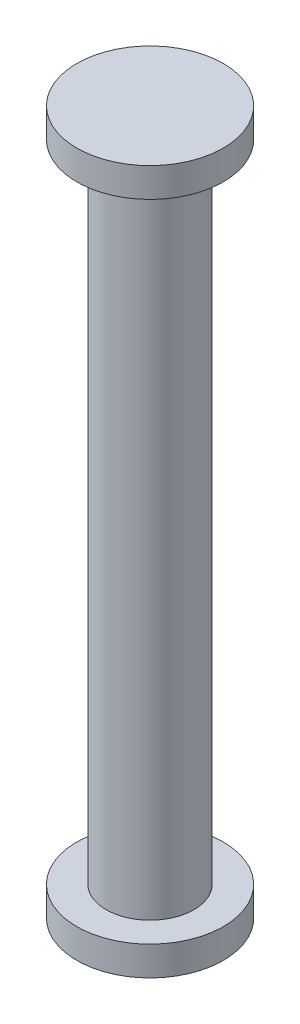
ISO-10303-21;
HEADER;
FILE_DESCRIPTION(('STEP AP214'),'2;1');
FILE_NAME('part.step','',(''),(''),'','','');
FILE_SCHEMA(('AUTOMOTIVE_DESIGN { 1 0 10303 214 1 1 1 1 }'));
ENDSEC;
DATA;
#1=APPLICATION_CONTEXT('core data for automotive mechanical design processes');
#2=APPLICATION_PROTOCOL_DEFINITION('international standard','automotive_design',2000,#1);
#3=PRODUCT_CONTEXT('',#1,'mechanical');
#4=PRODUCT('Part','Part','',(#3));
#5=PRODUCT_RELATED_PRODUCT_CATEGORY('part','',(#4));
#6=PRODUCT_DEFINITION_FORMATION('','',#4);
#7=PRODUCT_DEFINITION_CONTEXT('part definition',#1,'design');
#8=PRODUCT_DEFINITION('design','',#6,#7);
#9=PRODUCT_DEFINITION_SHAPE('','',#8);
#10=(LENGTH_UNIT() NAMED_UNIT(*) SI_UNIT(.MILLI.,.METRE.));
#11=(NAMED_UNIT(*) PLANE_ANGLE_UNIT() SI_UNIT($,.RADIAN.));
#12=(NAMED_UNIT(*) SI_UNIT($,.STERADIAN.) SOLID_ANGLE_UNIT());
#13=UNCERTAINTY_MEASURE_WITH_UNIT(LENGTH_MEASURE(1.E-05),#10,'distance_accuracy_value','');
#14=(GEOMETRIC_REPRESENTATION_CONTEXT(3) GLOBAL_UNCERTAINTY_ASSIGNED_CONTEXT((#13)) GLOBAL_UNIT_ASSIGNED_CONTEXT((#10,
#11,#12)) REPRESENTATION_CONTEXT('',''));
#15=CARTESIAN_POINT('',(0.,0.,0.));
#16=DIRECTION('',(0.,0.,1.));
#17=DIRECTION('',(1.,0.,0.));
#18=AXIS2_PLACEMENT_3D('',#15,#16,#17);
#19=CARTESIAN_POINT('',(-2.5,0.,0.));
#20=DIRECTION('',(0.,1.,0.));
#21=DIRECTION('',(0.,0.,1.));
#22=AXIS2_PLACEMENT_3D('',#19,#20,#21);
#23=PLANE('',#22);
#24=CARTESIAN_POINT('',(0.,0.,0.));
#25=DIRECTION('',(0.,-1.,0.));
#26=DIRECTION('',(0.,0.,-1.));
#27=AXIS2_PLACEMENT_3D('',#24,#25,#26);
#28=CIRCLE('',#27,2.5);
#29=CARTESIAN_POINT('',(0.,0.,-2.5));
#30=VERTEX_POINT('',#29);
#31=EDGE_CURVE('E57',#30,#30,#28,.T.);
#32=ORIENTED_EDGE('',*,*,#31,.T.);
#33=EDGE_LOOP('',(#32));
#34=FACE_BOUND('',#33,.T.);
#35=ADVANCED_FACE('F35',(#34),#23,.F.);
#36=CARTESIAN_POINT('',(0.,24.,0.));
#37=DIRECTION('',(0.,-1.,0.));
#38=DIRECTION('',(0.,0.,-1.));
#39=AXIS2_PLACEMENT_3D('',#36,#37,#38);
#40=PLANE('',#39);
#41=CARTESIAN_POINT('',(0.,24.,0.));
#42=DIRECTION('',(0.,-1.,0.));
#43=DIRECTION('',(0.,0.,-1.));
#44=AXIS2_PLACEMENT_3D('',#41,#42,#43);
#45=CIRCLE('',#44,2.5);
#46=CARTESIAN_POINT('',(0.,24.,-2.5));
#47=VERTEX_POINT('',#46);
#48=EDGE_CURVE('E10',#47,#47,#45,.T.);
#49=ORIENTED_EDGE('',*,*,#48,.F.);
#50=EDGE_LOOP('',(#49));
#51=FACE_BOUND('',#50,.T.);
#52=ADVANCED_FACE('F87',(#51),#40,.F.);
#53=CARTESIAN_POINT('',(0.,0.,0.));
#54=DIRECTION('',(0.,-1.,0.));
#55=DIRECTION('',(0.,0.,-1.));
#56=AXIS2_PLACEMENT_3D('',#53,#54,#55);
#57=CYLINDRICAL_SURFACE('',#56,2.5);
#58=CARTESIAN_POINT('',(0.,23.,0.));
#59=DIRECTION('',(0.,-1.,0.));
#60=DIRECTION('',(0.,0.,-1.));
#61=AXIS2_PLACEMENT_3D('',#58,#59,#60);
#62=CIRCLE('',#61,2.5);
#63=CARTESIAN_POINT('',(0.,23.,-2.5));
#64=VERTEX_POINT('',#63);
#65=EDGE_CURVE('E41',#64,#64,#62,.T.);
#66=ORIENTED_EDGE('',*,*,#65,.F.);
#67=EDGE_LOOP('',(#66));
#68=FACE_BOUND('',#67,.T.);
#69=ORIENTED_EDGE('',*,*,#48,.T.);
#70=EDGE_LOOP('',(#69));
#71=FACE_BOUND('',#70,.T.);
#72=ADVANCED_FACE('F82',(#68,#71),#57,.T.);
#73=CARTESIAN_POINT('',(-2.5,23.,0.));
#74=DIRECTION('',(0.,1.,0.));
#75=DIRECTION('',(0.,0.,1.));
#76=AXIS2_PLACEMENT_3D('',#73,#74,#75);
#77=PLANE('',#76);
#78=CARTESIAN_POINT('',(0.,23.,0.));
#79=DIRECTION('',(0.,-1.,0.));
#80=DIRECTION('',(0.,0.,-1.));
#81=AXIS2_PLACEMENT_3D('',#78,#79,#80);
#82=CIRCLE('',#81,1.5);
#83=CARTESIAN_POINT('',(0.,23.,-1.5));
#84=VERTEX_POINT('',#83);
#85=EDGE_CURVE('E45',#84,#84,#82,.T.);
#86=ORIENTED_EDGE('',*,*,#85,.F.);
#87=EDGE_LOOP('',(#86));
#88=FACE_BOUND('',#87,.T.);
#89=ORIENTED_EDGE('',*,*,#65,.T.);
#90=EDGE_LOOP('',(#89));
#91=FACE_BOUND('',#90,.T.);
#92=ADVANCED_FACE('F77',(#88,#91),#77,.F.);
#93=CARTESIAN_POINT('',(0.,0.,0.));
#94=DIRECTION('',(0.,-1.,0.));
#95=DIRECTION('',(0.,0.,-1.));
#96=AXIS2_PLACEMENT_3D('',#93,#94,#95);
#97=CYLINDRICAL_SURFACE('',#96,1.5);
#98=CARTESIAN_POINT('',(0.,1.,0.));
#99=DIRECTION('',(0.,-1.,0.));
#100=DIRECTION('',(0.,0.,-1.));
#101=AXIS2_PLACEMENT_3D('',#98,#99,#100);
#102=CIRCLE('',#101,1.5);
#103=CARTESIAN_POINT('',(0.,1.,-1.5));
#104=VERTEX_POINT('',#103);
#105=EDGE_CURVE('E49',#104,#104,#102,.T.);
#106=ORIENTED_EDGE('',*,*,#105,.F.);
#107=EDGE_LOOP('',(#106));
#108=FACE_BOUND('',#107,.T.);
#109=ORIENTED_EDGE('',*,*,#85,.T.);
#110=EDGE_LOOP('',(#109));
#111=FACE_BOUND('',#110,.T.);
#112=ADVANCED_FACE('F71',(#108,#111),#97,.T.);
#113=CARTESIAN_POINT('',(-1.5,1.,0.));
#114=DIRECTION('',(0.,-1.,0.));
#115=DIRECTION('',(0.,0.,-1.));
#116=AXIS2_PLACEMENT_3D('',#113,#114,#115);
#117=PLANE('',#116);
#118=CARTESIAN_POINT('',(0.,1.,0.));
#119=DIRECTION('',(0.,-1.,0.));
#120=DIRECTION('',(0.,0.,-1.));
#121=AXIS2_PLACEMENT_3D('',#118,#119,#120);
#122=CIRCLE('',#121,2.5);
#123=CARTESIAN_POINT('',(0.,1.,-2.5));
#124=VERTEX_POINT('',#123);
#125=EDGE_CURVE('E54',#124,#124,#122,.T.);
#126=ORIENTED_EDGE('',*,*,#125,.F.);
#127=EDGE_LOOP('',(#126));
#128=FACE_BOUND('',#127,.T.);
#129=ORIENTED_EDGE('',*,*,#105,.T.);
#130=EDGE_LOOP('',(#129));
#131=FACE_BOUND('',#130,.T.);
#132=ADVANCED_FACE('F65',(#128,#131),#117,.F.);
#133=CARTESIAN_POINT('',(0.,0.,0.));
#134=DIRECTION('',(0.,-1.,0.));
#135=DIRECTION('',(0.,0.,-1.));
#136=AXIS2_PLACEMENT_3D('',#133,#134,#135);
#137=CYLINDRICAL_SURFACE('',#136,2.5);
#138=ORIENTED_EDGE('',*,*,#31,.F.);
#139=EDGE_LOOP('',(#138));
#140=FACE_BOUND('',#139,.T.);
#141=ORIENTED_EDGE('',*,*,#125,.T.);
#142=EDGE_LOOP('',(#141));
#143=FACE_BOUND('',#142,.T.);
#144=ADVANCED_FACE('F62',(#140,#143),#137,.T.);
#145=CLOSED_SHELL('',(#35,#52,#72,#92,#112,#132,#144));
#146=MANIFOLD_SOLID_BREP('B2',#145);
#147=ADVANCED_BREP_SHAPE_REPRESENTATION('',(#18,#146),#14);
#148=SHAPE_DEFINITION_REPRESENTATION(#9,#147);
ENDSEC;
END-ISO-10303-21;
